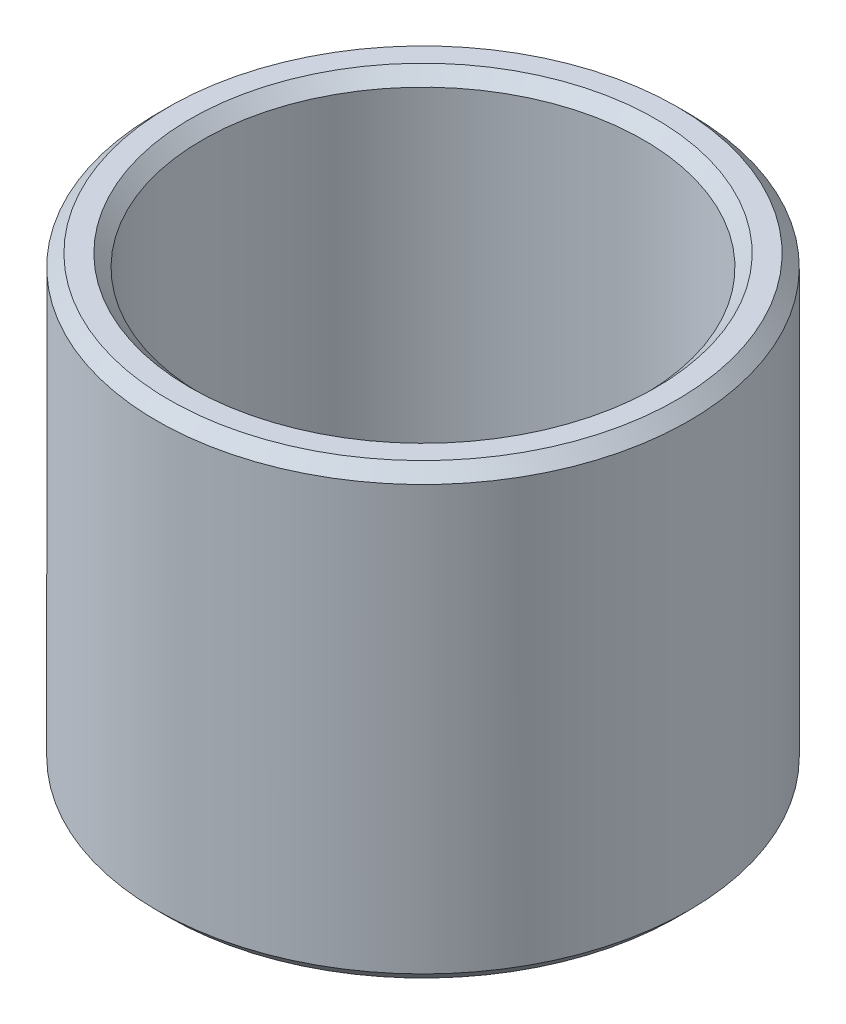
ISO-10303-21;
HEADER;
FILE_DESCRIPTION(('STEP AP214'),'2;1');
FILE_NAME('part.step','',(''),(''),'','','');
FILE_SCHEMA(('AUTOMOTIVE_DESIGN { 1 0 10303 214 1 1 1 1 }'));
ENDSEC;
DATA;
#1=APPLICATION_CONTEXT('core data for automotive mechanical design processes');
#2=APPLICATION_PROTOCOL_DEFINITION('international standard','automotive_design',2000,#1);
#3=PRODUCT_CONTEXT('',#1,'mechanical');
#4=PRODUCT('Part','Part','',(#3));
#5=PRODUCT_RELATED_PRODUCT_CATEGORY('part','',(#4));
#6=PRODUCT_DEFINITION_FORMATION('','',#4);
#7=PRODUCT_DEFINITION_CONTEXT('part definition',#1,'design');
#8=PRODUCT_DEFINITION('design','',#6,#7);
#9=PRODUCT_DEFINITION_SHAPE('','',#8);
#10=(LENGTH_UNIT() NAMED_UNIT(*) SI_UNIT(.MILLI.,.METRE.));
#11=(NAMED_UNIT(*) PLANE_ANGLE_UNIT() SI_UNIT($,.RADIAN.));
#12=(NAMED_UNIT(*) SI_UNIT($,.STERADIAN.) SOLID_ANGLE_UNIT());
#13=UNCERTAINTY_MEASURE_WITH_UNIT(LENGTH_MEASURE(1.E-05),#10,'distance_accuracy_value','');
#14=(GEOMETRIC_REPRESENTATION_CONTEXT(3) GLOBAL_UNCERTAINTY_ASSIGNED_CONTEXT((#13)) GLOBAL_UNIT_ASSIGNED_CONTEXT((#10,
#11,#12)) REPRESENTATION_CONTEXT('',''));
#15=CARTESIAN_POINT('',(0.,0.,0.));
#16=DIRECTION('',(0.,0.,1.));
#17=DIRECTION('',(1.,0.,0.));
#18=AXIS2_PLACEMENT_3D('',#15,#16,#17);
#19=CARTESIAN_POINT('',(0.,80.002165873386,0.));
#20=DIRECTION('',(0.,-1.,0.));
#21=DIRECTION('',(0.,0.,-1.));
#22=AXIS2_PLACEMENT_3D('',#19,#20,#21);
#23=CYLINDRICAL_SURFACE('',#22,47.5);
#24=CARTESIAN_POINT('',(0.,2.16925712066235,0.));
#25=DIRECTION('',(0.,1.,0.));
#26=DIRECTION('',(0.,0.,1.));
#27=AXIS2_PLACEMENT_3D('',#24,#25,#26);
#28=CIRCLE('',#27,47.5);
#29=CARTESIAN_POINT('',(0.,2.16925712066235,47.5));
#30=VERTEX_POINT('',#29);
#31=EDGE_CURVE('E10',#30,#30,#28,.T.);
#32=ORIENTED_EDGE('',*,*,#31,.T.);
#33=EDGE_LOOP('',(#32));
#34=FACE_BOUND('',#33,.T.);
#35=CARTESIAN_POINT('',(0.,77.8329087527237,0.));
#36=DIRECTION('',(0.,1.,0.));
#37=DIRECTION('',(0.,0.,1.));
#38=AXIS2_PLACEMENT_3D('',#35,#36,#37);
#39=CIRCLE('',#38,47.5);
#40=CARTESIAN_POINT('',(0.,77.8329087527237,-47.5));
#41=VERTEX_POINT('',#40);
#42=EDGE_CURVE('E50',#41,#41,#39,.F.);
#43=ORIENTED_EDGE('',*,*,#42,.T.);
#44=EDGE_LOOP('',(#43));
#45=FACE_BOUND('',#44,.T.);
#46=ADVANCED_FACE('F39',(#34,#45),#23,.T.);
#47=CARTESIAN_POINT('',(0.,80.002165873386,0.));
#48=DIRECTION('',(0.,1.,0.));
#49=DIRECTION('',(0.,0.,1.));
#50=AXIS2_PLACEMENT_3D('',#47,#48,#49);
#51=PLANE('',#50);
#52=CARTESIAN_POINT('',(0.,80.002165873386,0.));
#53=DIRECTION('',(0.,1.,0.));
#54=DIRECTION('',(0.,0.,1.));
#55=AXIS2_PLACEMENT_3D('',#52,#53,#54);
#56=CIRCLE('',#55,41.5517758842167);
#57=CARTESIAN_POINT('',(0.,80.002165873386,41.5517758842167));
#58=VERTEX_POINT('',#57);
#59=EDGE_CURVE('E58',#58,#58,#56,.F.);
#60=ORIENTED_EDGE('',*,*,#59,.T.);
#61=EDGE_LOOP('',(#60));
#62=FACE_BOUND('',#61,.T.);
#63=CARTESIAN_POINT('',(0.,80.002165873386,0.));
#64=DIRECTION('',(0.,1.,0.));
#65=DIRECTION('',(0.,0.,1.));
#66=AXIS2_PLACEMENT_3D('',#63,#64,#65);
#67=CIRCLE('',#66,45.3307428793377);
#68=CARTESIAN_POINT('',(0.,80.002165873386,-45.3307428793377));
#69=VERTEX_POINT('',#68);
#70=EDGE_CURVE('E61',#69,#69,#67,.T.);
#71=ORIENTED_EDGE('',*,*,#70,.T.);
#72=EDGE_LOOP('',(#71));
#73=FACE_BOUND('',#72,.T.);
#74=ADVANCED_FACE('F88',(#62,#73),#51,.T.);
#75=CARTESIAN_POINT('',(0.,0.,0.));
#76=DIRECTION('',(0.,1.,0.));
#77=DIRECTION('',(0.,0.,1.));
#78=AXIS2_PLACEMENT_3D('',#75,#76,#77);
#79=PLANE('',#78);
#80=CARTESIAN_POINT('',(0.,0.,0.));
#81=DIRECTION('',(0.,1.,0.));
#82=DIRECTION('',(0.,0.,1.));
#83=AXIS2_PLACEMENT_3D('',#80,#81,#82);
#84=CIRCLE('',#83,41.5517758842167);
#85=CARTESIAN_POINT('',(0.,0.,41.5517758842167));
#86=VERTEX_POINT('',#85);
#87=EDGE_CURVE('E51',#86,#86,#84,.T.);
#88=ORIENTED_EDGE('',*,*,#87,.T.);
#89=EDGE_LOOP('',(#88));
#90=FACE_BOUND('',#89,.T.);
#91=CARTESIAN_POINT('',(0.,0.,0.));
#92=DIRECTION('',(0.,1.,0.));
#93=DIRECTION('',(0.,0.,1.));
#94=AXIS2_PLACEMENT_3D('',#91,#92,#93);
#95=CIRCLE('',#94,45.3307428793376);
#96=CARTESIAN_POINT('',(0.,0.,45.3307428793376));
#97=VERTEX_POINT('',#96);
#98=EDGE_CURVE('E54',#97,#97,#95,.F.);
#99=ORIENTED_EDGE('',*,*,#98,.T.);
#100=EDGE_LOOP('',(#99));
#101=FACE_BOUND('',#100,.T.);
#102=ADVANCED_FACE('F83',(#90,#101),#79,.F.);
#103=CARTESIAN_POINT('',(0.,80.002165873386,0.));
#104=DIRECTION('',(0.,-1.,0.));
#105=DIRECTION('',(0.,0.,-1.));
#106=AXIS2_PLACEMENT_3D('',#103,#104,#105);
#107=CYLINDRICAL_SURFACE('',#106,39.3825187635543);
#108=CARTESIAN_POINT('',(0.,77.8329087527237,0.));
#109=DIRECTION('',(0.,1.,0.));
#110=DIRECTION('',(0.,0.,1.));
#111=AXIS2_PLACEMENT_3D('',#108,#109,#110);
#112=CIRCLE('',#111,39.3825187635543);
#113=CARTESIAN_POINT('',(0.,77.8329087527237,39.3825187635543));
#114=VERTEX_POINT('',#113);
#115=EDGE_CURVE('E67',#114,#114,#112,.T.);
#116=ORIENTED_EDGE('',*,*,#115,.T.);
#117=EDGE_LOOP('',(#116));
#118=FACE_BOUND('',#117,.T.);
#119=CARTESIAN_POINT('',(0.,2.16925712066235,0.));
#120=DIRECTION('',(0.,1.,0.));
#121=DIRECTION('',(0.,0.,1.));
#122=AXIS2_PLACEMENT_3D('',#119,#120,#121);
#123=CIRCLE('',#122,39.3825187635543);
#124=CARTESIAN_POINT('',(0.,2.16925712066235,39.3825187635543));
#125=VERTEX_POINT('',#124);
#126=EDGE_CURVE('E69',#125,#125,#123,.F.);
#127=ORIENTED_EDGE('',*,*,#126,.T.);
#128=EDGE_LOOP('',(#127));
#129=FACE_BOUND('',#128,.T.);
#130=ADVANCED_FACE('F71',(#118,#129),#107,.F.);
#131=CARTESIAN_POINT('',(0.,77.8329087527237,0.));
#132=DIRECTION('',(0.,1.,0.));
#133=DIRECTION('',(0.,0.,1.));
#134=AXIS2_PLACEMENT_3D('',#131,#132,#133);
#135=CONICAL_SURFACE('',#134,39.3825187635543,0.785398163397456);
#136=ORIENTED_EDGE('',*,*,#59,.F.);
#137=EDGE_LOOP('',(#136));
#138=FACE_BOUND('',#137,.T.);
#139=ORIENTED_EDGE('',*,*,#115,.F.);
#140=EDGE_LOOP('',(#139));
#141=FACE_BOUND('',#140,.T.);
#142=ADVANCED_FACE('F77',(#138,#141),#135,.F.);
#143=CARTESIAN_POINT('',(0.,0.,0.));
#144=DIRECTION('',(0.,-1.,0.));
#145=DIRECTION('',(0.,0.,-1.));
#146=AXIS2_PLACEMENT_3D('',#143,#144,#145);
#147=CONICAL_SURFACE('',#146,41.5517758842167,0.785398163397447);
#148=ORIENTED_EDGE('',*,*,#126,.F.);
#149=EDGE_LOOP('',(#148));
#150=FACE_BOUND('',#149,.T.);
#151=ORIENTED_EDGE('',*,*,#87,.F.);
#152=EDGE_LOOP('',(#151));
#153=FACE_BOUND('',#152,.T.);
#154=ADVANCED_FACE('F73',(#150,#153),#147,.F.);
#155=CARTESIAN_POINT('',(0.,2.16925712066235,0.));
#156=DIRECTION('',(0.,1.,0.));
#157=DIRECTION('',(0.,0.,1.));
#158=AXIS2_PLACEMENT_3D('',#155,#156,#157);
#159=CONICAL_SURFACE('',#158,47.5,0.78539816339745);
#160=ORIENTED_EDGE('',*,*,#98,.F.);
#161=EDGE_LOOP('',(#160));
#162=FACE_BOUND('',#161,.T.);
#163=ORIENTED_EDGE('',*,*,#31,.F.);
#164=EDGE_LOOP('',(#163));
#165=FACE_BOUND('',#164,.T.);
#166=ADVANCED_FACE('F76',(#162,#165),#159,.T.);
#167=CARTESIAN_POINT('',(0.,80.002165873386,0.));
#168=DIRECTION('',(0.,-1.,0.));
#169=DIRECTION('',(0.,0.,-1.));
#170=AXIS2_PLACEMENT_3D('',#167,#168,#169);
#171=CONICAL_SURFACE('',#170,45.3307428793377,0.78539816339745);
#172=CARTESIAN_POINT('',(0.,77.8329087527237,-47.5));
#173=CARTESIAN_POINT('',(0.,77.8555051810639,-47.4774035716598));
#174=CARTESIAN_POINT('',(0.,77.8781016094041,-47.4548071433195));
#175=CARTESIAN_POINT('',(0.,77.9232944660846,-47.4096142866391));
#176=CARTESIAN_POINT('',(0.,77.9458908944248,-47.3870178582989));
#177=CARTESIAN_POINT('',(0.,77.9910837511053,-47.3418250016184));
#178=CARTESIAN_POINT('',(0.,78.0136801794455,-47.3192285732782));
#179=CARTESIAN_POINT('',(0.,78.058873036126,-47.2740357165977));
#180=CARTESIAN_POINT('',(0.,78.0814694644662,-47.2514392882575));
#181=CARTESIAN_POINT('',(0.,78.1266623211467,-47.206246431577));
#182=CARTESIAN_POINT('',(0.,78.1492587494869,-47.1836500032368));
#183=CARTESIAN_POINT('',(0.,78.1944516061674,-47.1384571465563));
#184=CARTESIAN_POINT('',(0.,78.2170480345076,-47.1158607182161));
#185=CARTESIAN_POINT('',(0.,78.2622408911881,-47.0706678615356));
#186=CARTESIAN_POINT('',(0.,78.2848373195283,-47.0480714331954));
#187=CARTESIAN_POINT('',(0.,78.3300301762088,-47.0028785765149));
#188=CARTESIAN_POINT('',(0.,78.352626604549,-46.9802821481747));
#189=CARTESIAN_POINT('',(0.,78.3978194612295,-46.9350892914942));
#190=CARTESIAN_POINT('',(0.,78.4204158895697,-46.912492863154));
#191=CARTESIAN_POINT('',(0.,78.4656087462502,-46.8673000064735));
#192=CARTESIAN_POINT('',(0.,78.4882051745904,-46.8447035781333));
#193=CARTESIAN_POINT('',(0.,78.5333980312709,-46.7995107214528));
#194=CARTESIAN_POINT('',(0.,78.5559944596111,-46.7769142931126));
#195=CARTESIAN_POINT('',(0.,78.6011873162916,-46.7317214364321));
#196=CARTESIAN_POINT('',(0.,78.6237837446318,-46.7091250080919));
#197=CARTESIAN_POINT('',(0.,78.6689766013123,-46.6639321514114));
#198=CARTESIAN_POINT('',(0.,78.6915730296525,-46.6413357230712));
#199=CARTESIAN_POINT('',(0.,78.736765886333,-46.5961428663907));
#200=CARTESIAN_POINT('',(0.,78.7593623146732,-46.5735464380505));
#201=CARTESIAN_POINT('',(0.,78.8045551713537,-46.52835358137));
#202=CARTESIAN_POINT('',(0.,78.8271515996939,-46.5057571530298));
#203=CARTESIAN_POINT('',(0.,78.8723444563743,-46.4605642963493));
#204=CARTESIAN_POINT('',(0.,78.8949408847146,-46.4379678680091));
#205=CARTESIAN_POINT('',(0.,78.9401337413951,-46.3927750113286));
#206=CARTESIAN_POINT('',(0.,78.9627301697353,-46.3701785829884));
#207=CARTESIAN_POINT('',(0.,79.0079230264158,-46.3249857263079));
#208=CARTESIAN_POINT('',(0.,79.030519454756,-46.3023892979677));
#209=CARTESIAN_POINT('',(0.,79.0757123114364,-46.2571964412872));
#210=CARTESIAN_POINT('',(0.,79.0983087397767,-46.234600012947));
#211=CARTESIAN_POINT('',(0.,79.1435015964572,-46.1894071562665));
#212=CARTESIAN_POINT('',(0.,79.1660980247974,-46.1668107279263));
#213=CARTESIAN_POINT('',(0.,79.2112908814779,-46.1216178712458));
#214=CARTESIAN_POINT('',(0.,79.2338873098181,-46.0990214429056));
#215=CARTESIAN_POINT('',(0.,79.2790801664985,-46.0538285862251));
#216=CARTESIAN_POINT('',(0.,79.3016765948388,-46.0312321578849));
#217=CARTESIAN_POINT('',(0.,79.3468694515192,-45.9860393012044));
#218=CARTESIAN_POINT('',(0.,79.3694658798595,-45.9634428728642));
#219=CARTESIAN_POINT('',(0.,79.4146587365399,-45.9182500161837));
#220=CARTESIAN_POINT('',(0.,79.4372551648802,-45.8956535878435));
#221=CARTESIAN_POINT('',(0.,79.4824480215606,-45.850460731163));
#222=CARTESIAN_POINT('',(0.,79.5050444499009,-45.8278643028228));
#223=CARTESIAN_POINT('',(0.,79.5502373065813,-45.7826714461423));
#224=CARTESIAN_POINT('',(0.,79.5728337349216,-45.7600750178021));
#225=CARTESIAN_POINT('',(0.,79.618026591602,-45.7148821611216));
#226=CARTESIAN_POINT('',(0.,79.6406230199423,-45.6922857327814));
#227=CARTESIAN_POINT('',(0.,79.6858158766227,-45.6470928761009));
#228=CARTESIAN_POINT('',(0.,79.7084123049629,-45.6244964477607));
#229=CARTESIAN_POINT('',(0.,79.7536051616434,-45.5793035910802));
#230=CARTESIAN_POINT('',(0.,79.7762015899837,-45.55670716274));
#231=CARTESIAN_POINT('',(0.,79.8213944466641,-45.5115143060595));
#232=CARTESIAN_POINT('',(0.,79.8439908750044,-45.4889178777193));
#233=CARTESIAN_POINT('',(0.,79.8891837316848,-45.4437250210389));
#234=CARTESIAN_POINT('',(0.,79.911780160025,-45.4211285926986));
#235=CARTESIAN_POINT('',(0.,79.9569730167055,-45.3759357360182));
#236=CARTESIAN_POINT('',(0.,79.9795694450458,-45.3533393076779));
#237=CARTESIAN_POINT('',(0.,80.002165873386,-45.3307428793377));
#238=B_SPLINE_CURVE_WITH_KNOTS('',3,(#172,#173,#174,#175,#176,#177,#178,#179,#180,#181,#182,
#183,#184,#185,#186,#187,#188,#189,#190,#191,#192,#193,#194,#195,#196,#197,#198,#199,#200,#201,
#202,#203,#204,#205,#206,#207,#208,#209,#210,#211,#212,#213,#214,#215,#216,#217,#218,#219,#220,
#221,#222,#223,#224,#225,#226,#227,#228,#229,#230,#231,#232,#233,#234,#235,#236,#237),
.UNSPECIFIED.,.F.,.F.,(4,2,2,2,2,2,2,2,2,2,2,2,2,2,2,2,2,2,2,2,2,2,2,2,2,2,2,2,2,2,2,2,4),(0.,
0.0958685262598494,0.191737052519694,0.287605578779543,0.383474105039393,0.479342631299237,
0.575211157559077,0.671079683818926,0.766948210078771,0.86281673633862,0.958685262598465,
1.0545537888583,1.15042231511815,1.246290841378,1.34215936763785,1.4380278938977,
1.53389642015753,1.62976494641738,1.72563347267723,1.82150199893708,1.91737052519693,
2.01323905145677,2.10910757771661,2.20497610397646,2.30084463023631,2.39671315649615,
2.492581682756,2.58845020901584,2.68431873527569,2.78018726153554,2.87605578779538,
2.97192431405523,3.06779284031508),.UNSPECIFIED.);
#239=EDGE_CURVE('BSEAM45',#41,#69,#238,.T.);
#240=ORIENTED_EDGE('',*,*,#42,.F.);
#241=ORIENTED_EDGE('',*,*,#70,.F.);
#242=ORIENTED_EDGE('',*,*,#239,.T.);
#243=ORIENTED_EDGE('',*,*,#239,.F.);
#244=EDGE_LOOP('',(#240,#242,#241,#243));
#245=FACE_BOUND('',#244,.T.);
#246=ADVANCED_FACE('F45',(#245),#171,.T.);
#247=CLOSED_SHELL('',(#46,#74,#102,#130,#142,#154,#166,#246));
#248=MANIFOLD_SOLID_BREP('B2',#247);
#249=ADVANCED_BREP_SHAPE_REPRESENTATION('',(#18,#248),#14);
#250=SHAPE_DEFINITION_REPRESENTATION(#9,#249);
ENDSEC;
END-ISO-10303-21;
